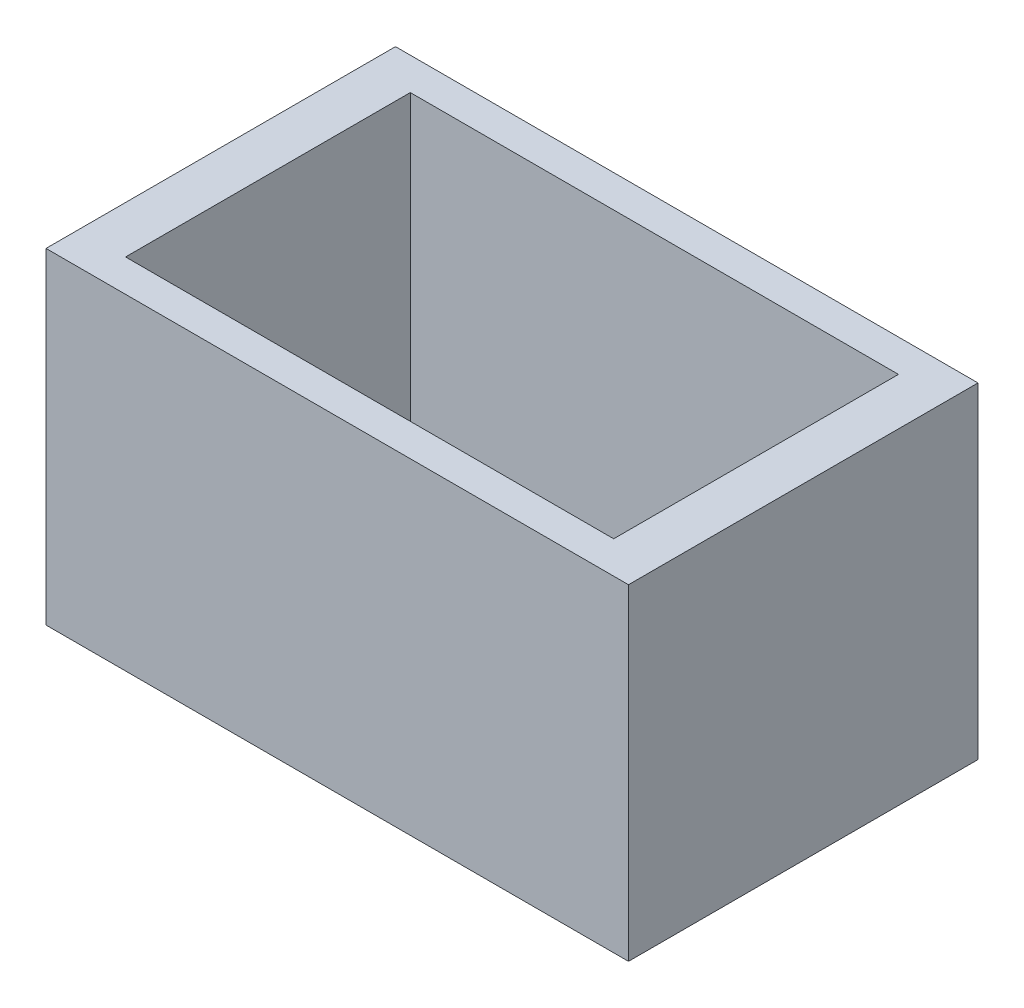
ISO-10303-21;
HEADER;
FILE_DESCRIPTION(('STEP AP214'),'2;1');
FILE_NAME('part.step','',(''),(''),'','','');
FILE_SCHEMA(('AUTOMOTIVE_DESIGN { 1 0 10303 214 1 1 1 1 }'));
ENDSEC;
DATA;
#1=APPLICATION_CONTEXT('core data for automotive mechanical design processes');
#2=APPLICATION_PROTOCOL_DEFINITION('international standard','automotive_design',2000,#1);
#3=PRODUCT_CONTEXT('',#1,'mechanical');
#4=PRODUCT('Part','Part','',(#3));
#5=PRODUCT_RELATED_PRODUCT_CATEGORY('part','',(#4));
#6=PRODUCT_DEFINITION_FORMATION('','',#4);
#7=PRODUCT_DEFINITION_CONTEXT('part definition',#1,'design');
#8=PRODUCT_DEFINITION('design','',#6,#7);
#9=PRODUCT_DEFINITION_SHAPE('','',#8);
#10=(LENGTH_UNIT() NAMED_UNIT(*) SI_UNIT(.MILLI.,.METRE.));
#11=(NAMED_UNIT(*) PLANE_ANGLE_UNIT() SI_UNIT($,.RADIAN.));
#12=(NAMED_UNIT(*) SI_UNIT($,.STERADIAN.) SOLID_ANGLE_UNIT());
#13=UNCERTAINTY_MEASURE_WITH_UNIT(LENGTH_MEASURE(1.E-05),#10,'distance_accuracy_value','');
#14=(GEOMETRIC_REPRESENTATION_CONTEXT(3) GLOBAL_UNCERTAINTY_ASSIGNED_CONTEXT((#13)) GLOBAL_UNIT_ASSIGNED_CONTEXT((#10,
#11,#12)) REPRESENTATION_CONTEXT('',''));
#15=CARTESIAN_POINT('',(0.,0.,0.));
#16=DIRECTION('',(0.,0.,1.));
#17=DIRECTION('',(1.,0.,0.));
#18=AXIS2_PLACEMENT_3D('',#15,#16,#17);
#19=CARTESIAN_POINT('',(-125.,140.,-75.));
#20=DIRECTION('',(1.,0.,0.));
#21=DIRECTION('',(0.,0.,-1.));
#22=AXIS2_PLACEMENT_3D('',#19,#20,#21);
#23=PLANE('',#22);
#24=DIRECTION('',(0.,0.,1.));
#25=VECTOR('',#24,1.);
#26=CARTESIAN_POINT('',(-125.,0.,-75.));
#27=LINE('',#26,#25);
#28=CARTESIAN_POINT('',(-125.,0.,-75.));
#29=VERTEX_POINT('',#28);
#30=CARTESIAN_POINT('',(-125.,0.,75.));
#31=VERTEX_POINT('',#30);
#32=EDGE_CURVE('E141',#29,#31,#27,.T.);
#33=ORIENTED_EDGE('',*,*,#32,.T.);
#34=DIRECTION('',(0.,-1.,0.));
#35=VECTOR('',#34,1.);
#36=CARTESIAN_POINT('',(-125.,140.,75.));
#37=LINE('',#36,#35);
#38=CARTESIAN_POINT('',(-125.,140.,75.));
#39=VERTEX_POINT('',#38);
#40=EDGE_CURVE('E11',#39,#31,#37,.T.);
#41=ORIENTED_EDGE('',*,*,#40,.F.);
#42=DIRECTION('',(0.,0.,1.));
#43=VECTOR('',#42,1.);
#44=CARTESIAN_POINT('',(-125.,140.,-75.));
#45=LINE('',#44,#43);
#46=CARTESIAN_POINT('',(-125.,140.,-75.));
#47=VERTEX_POINT('',#46);
#48=EDGE_CURVE('E145',#47,#39,#45,.T.);
#49=ORIENTED_EDGE('',*,*,#48,.F.);
#50=DIRECTION('',(0.,-1.,0.));
#51=VECTOR('',#50,1.);
#52=CARTESIAN_POINT('',(-125.,140.,-75.));
#53=LINE('',#52,#51);
#54=EDGE_CURVE('E151',#47,#29,#53,.T.);
#55=ORIENTED_EDGE('',*,*,#54,.T.);
#56=EDGE_LOOP('',(#33,#41,#49,#55));
#57=FACE_BOUND('',#56,.T.);
#58=ADVANCED_FACE('F33',(#57),#23,.F.);
#59=CARTESIAN_POINT('',(125.,140.,75.));
#60=DIRECTION('',(0.,0.,-1.));
#61=DIRECTION('',(-1.,0.,0.));
#62=AXIS2_PLACEMENT_3D('',#59,#60,#61);
#63=PLANE('',#62);
#64=DIRECTION('',(1.,0.,0.));
#65=VECTOR('',#64,1.);
#66=CARTESIAN_POINT('',(125.,0.,75.));
#67=LINE('',#66,#65);
#68=CARTESIAN_POINT('',(125.,0.,75.));
#69=VERTEX_POINT('',#68);
#70=EDGE_CURVE('E154',#31,#69,#67,.T.);
#71=ORIENTED_EDGE('',*,*,#70,.T.);
#72=DIRECTION('',(0.,-1.,0.));
#73=VECTOR('',#72,1.);
#74=CARTESIAN_POINT('',(125.,140.,75.));
#75=LINE('',#74,#73);
#76=CARTESIAN_POINT('',(125.,140.,75.));
#77=VERTEX_POINT('',#76);
#78=EDGE_CURVE('E40',#77,#69,#75,.T.);
#79=ORIENTED_EDGE('',*,*,#78,.F.);
#80=DIRECTION('',(1.,0.,0.));
#81=VECTOR('',#80,1.);
#82=CARTESIAN_POINT('',(125.,140.,75.));
#83=LINE('',#82,#81);
#84=EDGE_CURVE('E84',#39,#77,#83,.T.);
#85=ORIENTED_EDGE('',*,*,#84,.F.);
#86=ORIENTED_EDGE('',*,*,#40,.T.);
#87=EDGE_LOOP('',(#71,#79,#85,#86));
#88=FACE_BOUND('',#87,.T.);
#89=ADVANCED_FACE('F183',(#88),#63,.F.);
#90=CARTESIAN_POINT('',(125.,140.,-75.));
#91=DIRECTION('',(-1.,0.,0.));
#92=DIRECTION('',(0.,0.,1.));
#93=AXIS2_PLACEMENT_3D('',#90,#91,#92);
#94=PLANE('',#93);
#95=DIRECTION('',(0.,0.,-1.));
#96=VECTOR('',#95,1.);
#97=CARTESIAN_POINT('',(125.,0.,-75.));
#98=LINE('',#97,#96);
#99=CARTESIAN_POINT('',(125.,0.,-75.));
#100=VERTEX_POINT('',#99);
#101=EDGE_CURVE('E156',#69,#100,#98,.T.);
#102=ORIENTED_EDGE('',*,*,#101,.T.);
#103=DIRECTION('',(0.,-1.,0.));
#104=VECTOR('',#103,1.);
#105=CARTESIAN_POINT('',(125.,140.,-75.));
#106=LINE('',#105,#104);
#107=CARTESIAN_POINT('',(125.,140.,-75.));
#108=VERTEX_POINT('',#107);
#109=EDGE_CURVE('E160',#108,#100,#106,.T.);
#110=ORIENTED_EDGE('',*,*,#109,.F.);
#111=DIRECTION('',(0.,0.,-1.));
#112=VECTOR('',#111,1.);
#113=CARTESIAN_POINT('',(125.,140.,-75.));
#114=LINE('',#113,#112);
#115=EDGE_CURVE('E148',#77,#108,#114,.T.);
#116=ORIENTED_EDGE('',*,*,#115,.F.);
#117=ORIENTED_EDGE('',*,*,#78,.T.);
#118=EDGE_LOOP('',(#102,#110,#116,#117));
#119=FACE_BOUND('',#118,.T.);
#120=ADVANCED_FACE('F165',(#119),#94,.F.);
#121=CARTESIAN_POINT('',(125.,140.,-75.));
#122=DIRECTION('',(0.,0.,1.));
#123=DIRECTION('',(1.,0.,0.));
#124=AXIS2_PLACEMENT_3D('',#121,#122,#123);
#125=PLANE('',#124);
#126=DIRECTION('',(-1.,0.,0.));
#127=VECTOR('',#126,1.);
#128=CARTESIAN_POINT('',(125.,0.,-75.));
#129=LINE('',#128,#127);
#130=EDGE_CURVE('E77',#100,#29,#129,.T.);
#131=ORIENTED_EDGE('',*,*,#130,.T.);
#132=ORIENTED_EDGE('',*,*,#54,.F.);
#133=DIRECTION('',(-1.,0.,0.));
#134=VECTOR('',#133,1.);
#135=CARTESIAN_POINT('',(125.,140.,-75.));
#136=LINE('',#135,#134);
#137=EDGE_CURVE('E56',#108,#47,#136,.T.);
#138=ORIENTED_EDGE('',*,*,#137,.F.);
#139=ORIENTED_EDGE('',*,*,#109,.T.);
#140=EDGE_LOOP('',(#131,#132,#138,#139));
#141=FACE_BOUND('',#140,.T.);
#142=ADVANCED_FACE('F173',(#141),#125,.F.);
#143=CARTESIAN_POINT('',(0.,140.,0.));
#144=DIRECTION('',(0.,-1.,0.));
#145=DIRECTION('',(0.,0.,-1.));
#146=AXIS2_PLACEMENT_3D('',#143,#144,#145);
#147=PLANE('',#146);
#148=DIRECTION('',(1.,0.,0.));
#149=VECTOR('',#148,1.);
#150=CARTESIAN_POINT('',(104.752460978765,140.,61.1056022376126));
#151=LINE('',#150,#149);
#152=CARTESIAN_POINT('',(-104.752460978765,140.,61.1056022376126));
#153=VERTEX_POINT('',#152);
#154=CARTESIAN_POINT('',(104.752460978765,140.,61.1056022376126));
#155=VERTEX_POINT('',#154);
#156=EDGE_CURVE('E135',#153,#155,#151,.T.);
#157=ORIENTED_EDGE('',*,*,#156,.F.);
#158=DIRECTION('',(0.,0.,1.));
#159=VECTOR('',#158,1.);
#160=CARTESIAN_POINT('',(-104.752460978765,140.,-61.1056022376126));
#161=LINE('',#160,#159);
#162=CARTESIAN_POINT('',(-104.752460978765,140.,-61.1056022376126));
#163=VERTEX_POINT('',#162);
#164=EDGE_CURVE('E47',#163,#153,#161,.T.);
#165=ORIENTED_EDGE('',*,*,#164,.F.);
#166=DIRECTION('',(-1.,0.,0.));
#167=VECTOR('',#166,1.);
#168=CARTESIAN_POINT('',(104.752460978765,140.,-61.1056022376126));
#169=LINE('',#168,#167);
#170=CARTESIAN_POINT('',(104.752460978765,140.,-61.1056022376126));
#171=VERTEX_POINT('',#170);
#172=EDGE_CURVE('E126',#171,#163,#169,.T.);
#173=ORIENTED_EDGE('',*,*,#172,.F.);
#174=DIRECTION('',(0.,0.,-1.));
#175=VECTOR('',#174,1.);
#176=CARTESIAN_POINT('',(104.752460978765,140.,-61.1056022376126));
#177=LINE('',#176,#175);
#178=EDGE_CURVE('E129',#155,#171,#177,.T.);
#179=ORIENTED_EDGE('',*,*,#178,.F.);
#180=EDGE_LOOP('',(#157,#165,#173,#179));
#181=FACE_BOUND('',#180,.T.);
#182=ORIENTED_EDGE('',*,*,#48,.T.);
#183=ORIENTED_EDGE('',*,*,#84,.T.);
#184=ORIENTED_EDGE('',*,*,#115,.T.);
#185=ORIENTED_EDGE('',*,*,#137,.T.);
#186=EDGE_LOOP('',(#182,#183,#184,#185));
#187=FACE_BOUND('',#186,.T.);
#188=ADVANCED_FACE('F175',(#181,#187),#147,.F.);
#189=CARTESIAN_POINT('',(0.,0.,0.));
#190=DIRECTION('',(0.,-1.,0.));
#191=DIRECTION('',(0.,0.,-1.));
#192=AXIS2_PLACEMENT_3D('',#189,#190,#191);
#193=PLANE('',#192);
#194=ORIENTED_EDGE('',*,*,#32,.F.);
#195=ORIENTED_EDGE('',*,*,#130,.F.);
#196=ORIENTED_EDGE('',*,*,#101,.F.);
#197=ORIENTED_EDGE('',*,*,#70,.F.);
#198=EDGE_LOOP('',(#194,#195,#196,#197));
#199=FACE_BOUND('',#198,.T.);
#200=ADVANCED_FACE('F169',(#199),#193,.T.);
#201=CARTESIAN_POINT('',(-104.752460978765,10.,-61.1056022376126));
#202=DIRECTION('',(-1.,0.,0.));
#203=DIRECTION('',(0.,0.,1.));
#204=AXIS2_PLACEMENT_3D('',#201,#202,#203);
#205=PLANE('',#204);
#206=ORIENTED_EDGE('',*,*,#164,.T.);
#207=DIRECTION('',(0.,1.,0.));
#208=VECTOR('',#207,1.);
#209=CARTESIAN_POINT('',(-104.752460978765,10.,61.1056022376126));
#210=LINE('',#209,#208);
#211=CARTESIAN_POINT('',(-104.752460978765,10.,61.1056022376126));
#212=VERTEX_POINT('',#211);
#213=EDGE_CURVE('E104',#212,#153,#210,.T.);
#214=ORIENTED_EDGE('',*,*,#213,.F.);
#215=DIRECTION('',(0.,0.,1.));
#216=VECTOR('',#215,1.);
#217=CARTESIAN_POINT('',(-104.752460978765,10.,-61.1056022376126));
#218=LINE('',#217,#216);
#219=CARTESIAN_POINT('',(-104.752460978765,10.,-61.1056022376126));
#220=VERTEX_POINT('',#219);
#221=EDGE_CURVE('E108',#220,#212,#218,.T.);
#222=ORIENTED_EDGE('',*,*,#221,.F.);
#223=DIRECTION('',(0.,1.,0.));
#224=VECTOR('',#223,1.);
#225=CARTESIAN_POINT('',(-104.752460978765,10.,-61.1056022376126));
#226=LINE('',#225,#224);
#227=EDGE_CURVE('E139',#220,#163,#226,.T.);
#228=ORIENTED_EDGE('',*,*,#227,.T.);
#229=EDGE_LOOP('',(#206,#214,#222,#228));
#230=FACE_BOUND('',#229,.T.);
#231=ADVANCED_FACE('F106',(#230),#205,.F.);
#232=CARTESIAN_POINT('',(104.752460978765,10.,-61.1056022376126));
#233=DIRECTION('',(0.,0.,-1.));
#234=DIRECTION('',(-1.,0.,0.));
#235=AXIS2_PLACEMENT_3D('',#232,#233,#234);
#236=PLANE('',#235);
#237=ORIENTED_EDGE('',*,*,#172,.T.);
#238=ORIENTED_EDGE('',*,*,#227,.F.);
#239=DIRECTION('',(-1.,0.,0.));
#240=VECTOR('',#239,1.);
#241=CARTESIAN_POINT('',(104.752460978765,10.,-61.1056022376126));
#242=LINE('',#241,#240);
#243=CARTESIAN_POINT('',(104.752460978765,10.,-61.1056022376126));
#244=VERTEX_POINT('',#243);
#245=EDGE_CURVE('E114',#244,#220,#242,.T.);
#246=ORIENTED_EDGE('',*,*,#245,.F.);
#247=DIRECTION('',(0.,1.,0.));
#248=VECTOR('',#247,1.);
#249=CARTESIAN_POINT('',(104.752460978765,10.,-61.1056022376126));
#250=LINE('',#249,#248);
#251=EDGE_CURVE('E142',#244,#171,#250,.T.);
#252=ORIENTED_EDGE('',*,*,#251,.T.);
#253=EDGE_LOOP('',(#237,#238,#246,#252));
#254=FACE_BOUND('',#253,.T.);
#255=ADVANCED_FACE('F222',(#254),#236,.F.);
#256=CARTESIAN_POINT('',(104.752460978765,10.,-61.1056022376126));
#257=DIRECTION('',(1.,0.,0.));
#258=DIRECTION('',(0.,0.,-1.));
#259=AXIS2_PLACEMENT_3D('',#256,#257,#258);
#260=PLANE('',#259);
#261=ORIENTED_EDGE('',*,*,#178,.T.);
#262=ORIENTED_EDGE('',*,*,#251,.F.);
#263=DIRECTION('',(0.,0.,-1.));
#264=VECTOR('',#263,1.);
#265=CARTESIAN_POINT('',(104.752460978765,10.,-61.1056022376126));
#266=LINE('',#265,#264);
#267=CARTESIAN_POINT('',(104.752460978765,10.,61.1056022376126));
#268=VERTEX_POINT('',#267);
#269=EDGE_CURVE('E122',#268,#244,#266,.T.);
#270=ORIENTED_EDGE('',*,*,#269,.F.);
#271=DIRECTION('',(0.,1.,0.));
#272=VECTOR('',#271,1.);
#273=CARTESIAN_POINT('',(104.752460978765,10.,61.1056022376126));
#274=LINE('',#273,#272);
#275=EDGE_CURVE('E113',#268,#155,#274,.T.);
#276=ORIENTED_EDGE('',*,*,#275,.T.);
#277=EDGE_LOOP('',(#261,#262,#270,#276));
#278=FACE_BOUND('',#277,.T.);
#279=ADVANCED_FACE('F231',(#278),#260,.F.);
#280=CARTESIAN_POINT('',(104.752460978765,10.,61.1056022376126));
#281=DIRECTION('',(0.,0.,1.));
#282=DIRECTION('',(1.,0.,0.));
#283=AXIS2_PLACEMENT_3D('',#280,#281,#282);
#284=PLANE('',#283);
#285=ORIENTED_EDGE('',*,*,#156,.T.);
#286=ORIENTED_EDGE('',*,*,#275,.F.);
#287=DIRECTION('',(1.,0.,0.));
#288=VECTOR('',#287,1.);
#289=CARTESIAN_POINT('',(104.752460978765,10.,61.1056022376126));
#290=LINE('',#289,#288);
#291=EDGE_CURVE('E117',#212,#268,#290,.T.);
#292=ORIENTED_EDGE('',*,*,#291,.F.);
#293=ORIENTED_EDGE('',*,*,#213,.T.);
#294=EDGE_LOOP('',(#285,#286,#292,#293));
#295=FACE_BOUND('',#294,.T.);
#296=ADVANCED_FACE('F118',(#295),#284,.F.);
#297=CARTESIAN_POINT('',(0.,10.,0.));
#298=DIRECTION('',(0.,-1.,0.));
#299=DIRECTION('',(0.,0.,-1.));
#300=AXIS2_PLACEMENT_3D('',#297,#298,#299);
#301=PLANE('',#300);
#302=ORIENTED_EDGE('',*,*,#221,.T.);
#303=ORIENTED_EDGE('',*,*,#291,.T.);
#304=ORIENTED_EDGE('',*,*,#269,.T.);
#305=ORIENTED_EDGE('',*,*,#245,.T.);
#306=EDGE_LOOP('',(#302,#303,#304,#305));
#307=FACE_BOUND('',#306,.T.);
#308=ADVANCED_FACE('F124',(#307),#301,.F.);
#309=CLOSED_SHELL('',(#58,#89,#120,#142,#188,#200,#231,#255,#279,#296,#308));
#310=MANIFOLD_SOLID_BREP('B2',#309);
#311=ADVANCED_BREP_SHAPE_REPRESENTATION('',(#18,#310),#14);
#312=SHAPE_DEFINITION_REPRESENTATION(#9,#311);
ENDSEC;
END-ISO-10303-21;
